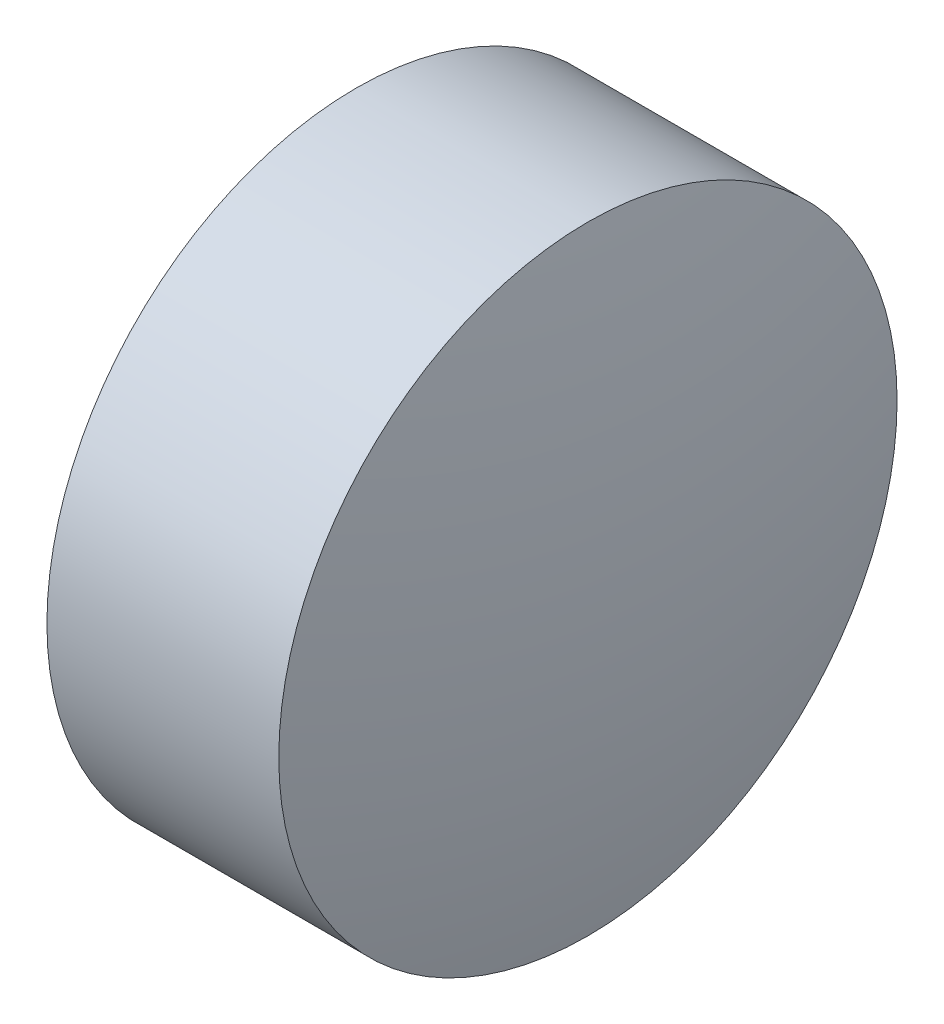
ISO-10303-21;
HEADER;
FILE_DESCRIPTION(('STEP AP214'),'2;1');
FILE_NAME('part.step','',(''),(''),'','','');
FILE_SCHEMA(('AUTOMOTIVE_DESIGN { 1 0 10303 214 1 1 1 1 }'));
ENDSEC;
DATA;
#1=APPLICATION_CONTEXT('core data for automotive mechanical design processes');
#2=APPLICATION_PROTOCOL_DEFINITION('international standard','automotive_design',2000,#1);
#3=PRODUCT_CONTEXT('',#1,'mechanical');
#4=PRODUCT('Part','Part','',(#3));
#5=PRODUCT_RELATED_PRODUCT_CATEGORY('part','',(#4));
#6=PRODUCT_DEFINITION_FORMATION('','',#4);
#7=PRODUCT_DEFINITION_CONTEXT('part definition',#1,'design');
#8=PRODUCT_DEFINITION('design','',#6,#7);
#9=PRODUCT_DEFINITION_SHAPE('','',#8);
#10=(LENGTH_UNIT() NAMED_UNIT(*) SI_UNIT(.MILLI.,.METRE.));
#11=(NAMED_UNIT(*) PLANE_ANGLE_UNIT() SI_UNIT($,.RADIAN.));
#12=(NAMED_UNIT(*) SI_UNIT($,.STERADIAN.) SOLID_ANGLE_UNIT());
#13=UNCERTAINTY_MEASURE_WITH_UNIT(LENGTH_MEASURE(1.E-05),#10,'distance_accuracy_value','');
#14=(GEOMETRIC_REPRESENTATION_CONTEXT(3) GLOBAL_UNCERTAINTY_ASSIGNED_CONTEXT((#13)) GLOBAL_UNIT_ASSIGNED_CONTEXT((#10,
#11,#12)) REPRESENTATION_CONTEXT('',''));
#15=CARTESIAN_POINT('',(0.,0.,0.));
#16=DIRECTION('',(0.,0.,1.));
#17=DIRECTION('',(1.,0.,0.));
#18=AXIS2_PLACEMENT_3D('',#15,#16,#17);
#19=CARTESIAN_POINT('',(694.152955338492,219.547615512977,0.));
#20=DIRECTION('',(-1.,0.,0.));
#21=DIRECTION('',(0.,-1.,0.));
#22=AXIS2_PLACEMENT_3D('',#19,#20,#21);
#23=SPHERICAL_SURFACE('',#22,9.20090909090909);
#24=CARTESIAN_POINT('',(703.133864429401,219.547615512977,0.));
#25=DIRECTION('',(-1.,0.,0.));
#26=DIRECTION('',(0.,0.,1.));
#27=AXIS2_PLACEMENT_3D('',#24,#25,#26);
#28=CIRCLE('',#27,2.);
#29=CARTESIAN_POINT('',(703.133864429401,219.547615512977,2.));
#30=VERTEX_POINT('',#29);
#31=EDGE_CURVE('E10',#30,#30,#28,.T.);
#32=ORIENTED_EDGE('',*,*,#31,.F.);
#33=EDGE_LOOP('',(#32));
#34=FACE_BOUND('',#33,.T.);
#35=ADVANCED_FACE('F35',(#34),#23,.T.);
#36=CARTESIAN_POINT('',(701.205757735354,219.547615512977,0.));
#37=DIRECTION('',(-1.,0.,0.));
#38=DIRECTION('',(0.,0.,1.));
#39=AXIS2_PLACEMENT_3D('',#36,#37,#38);
#40=CYLINDRICAL_SURFACE('',#39,2.);
#41=CARTESIAN_POINT('',(701.633864429401,219.547615512977,0.));
#42=DIRECTION('',(-1.,0.,0.));
#43=DIRECTION('',(0.,0.,1.));
#44=AXIS2_PLACEMENT_3D('',#41,#42,#43);
#45=CIRCLE('',#44,2.);
#46=CARTESIAN_POINT('',(701.633864429401,219.547615512977,2.));
#47=VERTEX_POINT('',#46);
#48=EDGE_CURVE('E41',#47,#47,#45,.T.);
#49=ORIENTED_EDGE('',*,*,#48,.F.);
#50=EDGE_LOOP('',(#49));
#51=FACE_BOUND('',#50,.T.);
#52=ORIENTED_EDGE('',*,*,#31,.T.);
#53=EDGE_LOOP('',(#52));
#54=FACE_BOUND('',#53,.T.);
#55=ADVANCED_FACE('F49',(#51,#54),#40,.T.);
#56=CARTESIAN_POINT('',(701.633864429401,219.547615512977,0.));
#57=DIRECTION('',(1.,0.,0.));
#58=DIRECTION('',(0.,0.,-1.));
#59=AXIS2_PLACEMENT_3D('',#56,#57,#58);
#60=PLANE('',#59);
#61=ORIENTED_EDGE('',*,*,#48,.T.);
#62=EDGE_LOOP('',(#61));
#63=FACE_BOUND('',#62,.T.);
#64=ADVANCED_FACE('F47',(#63),#60,.F.);
#65=CLOSED_SHELL('',(#35,#55,#64));
#66=MANIFOLD_SOLID_BREP('B2',#65);
#67=ADVANCED_BREP_SHAPE_REPRESENTATION('',(#18,#66),#14);
#68=SHAPE_DEFINITION_REPRESENTATION(#9,#67);
ENDSEC;
END-ISO-10303-21;
